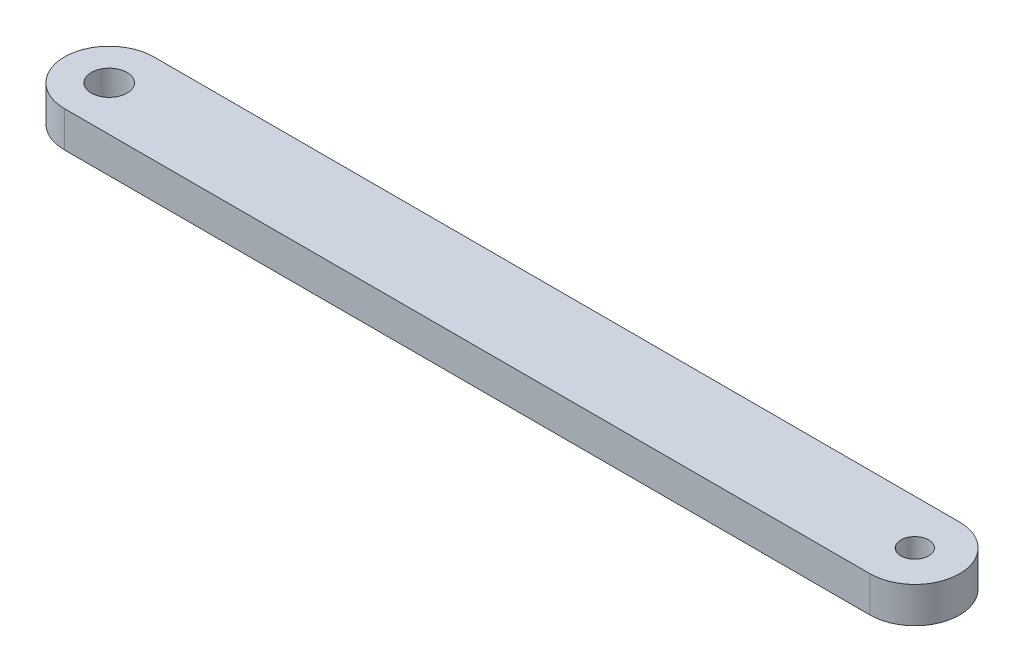
ISO-10303-21;
HEADER;
FILE_DESCRIPTION(('STEP AP214'),'2;1');
FILE_NAME('part.step','',(''),(''),'','','');
FILE_SCHEMA(('AUTOMOTIVE_DESIGN { 1 0 10303 214 1 1 1 1 }'));
ENDSEC;
DATA;
#1=APPLICATION_CONTEXT('core data for automotive mechanical design processes');
#2=APPLICATION_PROTOCOL_DEFINITION('international standard','automotive_design',2000,#1);
#3=PRODUCT_CONTEXT('',#1,'mechanical');
#4=PRODUCT('Part','Part','',(#3));
#5=PRODUCT_RELATED_PRODUCT_CATEGORY('part','',(#4));
#6=PRODUCT_DEFINITION_FORMATION('','',#4);
#7=PRODUCT_DEFINITION_CONTEXT('part definition',#1,'design');
#8=PRODUCT_DEFINITION('design','',#6,#7);
#9=PRODUCT_DEFINITION_SHAPE('','',#8);
#10=(LENGTH_UNIT() NAMED_UNIT(*) SI_UNIT(.MILLI.,.METRE.));
#11=(NAMED_UNIT(*) PLANE_ANGLE_UNIT() SI_UNIT($,.RADIAN.));
#12=(NAMED_UNIT(*) SI_UNIT($,.STERADIAN.) SOLID_ANGLE_UNIT());
#13=UNCERTAINTY_MEASURE_WITH_UNIT(LENGTH_MEASURE(1.E-05),#10,'distance_accuracy_value','');
#14=(GEOMETRIC_REPRESENTATION_CONTEXT(3) GLOBAL_UNCERTAINTY_ASSIGNED_CONTEXT((#13)) GLOBAL_UNIT_ASSIGNED_CONTEXT((#10,
#11,#12)) REPRESENTATION_CONTEXT('',''));
#15=CARTESIAN_POINT('',(0.,0.,0.));
#16=DIRECTION('',(0.,0.,1.));
#17=DIRECTION('',(1.,0.,0.));
#18=AXIS2_PLACEMENT_3D('',#15,#16,#17);
#19=CARTESIAN_POINT('',(0.,4.,0.));
#20=DIRECTION('',(0.,1.,0.));
#21=DIRECTION('',(0.,0.,1.));
#22=AXIS2_PLACEMENT_3D('',#19,#20,#21);
#23=PLANE('',#22);
#24=CARTESIAN_POINT('',(-90.,4.,0.));
#25=DIRECTION('',(0.,1.,0.));
#26=DIRECTION('',(0.,0.,1.));
#27=AXIS2_PLACEMENT_3D('',#24,#25,#26);
#28=CIRCLE('',#27,2.);
#29=CARTESIAN_POINT('',(-90.,4.,2.00000000000001));
#30=VERTEX_POINT('',#29);
#31=EDGE_CURVE('E112',#30,#30,#28,.T.);
#32=ORIENTED_EDGE('',*,*,#31,.F.);
#33=EDGE_LOOP('',(#32));
#34=FACE_BOUND('',#33,.T.);
#35=CARTESIAN_POINT('',(0.,4.,0.));
#36=DIRECTION('',(0.,1.,0.));
#37=DIRECTION('',(0.,0.,1.));
#38=AXIS2_PLACEMENT_3D('',#35,#36,#37);
#39=CIRCLE('',#38,5.);
#40=CARTESIAN_POINT('',(0.,4.,5.));
#41=VERTEX_POINT('',#40);
#42=CARTESIAN_POINT('',(0.,4.,-5.));
#43=VERTEX_POINT('',#42);
#44=EDGE_CURVE('E92',#41,#43,#39,.T.);
#45=ORIENTED_EDGE('',*,*,#44,.T.);
#46=DIRECTION('',(-1.,0.,0.));
#47=VECTOR('',#46,1.);
#48=CARTESIAN_POINT('',(0.,4.,-5.));
#49=LINE('',#48,#47);
#50=CARTESIAN_POINT('',(-90.,4.,-4.99999999999999));
#51=VERTEX_POINT('',#50);
#52=EDGE_CURVE('E87',#43,#51,#49,.T.);
#53=ORIENTED_EDGE('',*,*,#52,.T.);
#54=CARTESIAN_POINT('',(-90.,4.,0.));
#55=DIRECTION('',(0.,1.,0.));
#56=DIRECTION('',(0.,0.,1.));
#57=AXIS2_PLACEMENT_3D('',#54,#55,#56);
#58=CIRCLE('',#57,5.);
#59=CARTESIAN_POINT('',(-90.,4.,5.00000000000001));
#60=VERTEX_POINT('',#59);
#61=EDGE_CURVE('E90',#51,#60,#58,.T.);
#62=ORIENTED_EDGE('',*,*,#61,.T.);
#63=DIRECTION('',(1.,0.,0.));
#64=VECTOR('',#63,1.);
#65=CARTESIAN_POINT('',(0.,4.,5.));
#66=LINE('',#65,#64);
#67=EDGE_CURVE('E57',#60,#41,#66,.T.);
#68=ORIENTED_EDGE('',*,*,#67,.T.);
#69=EDGE_LOOP('',(#45,#53,#62,#68));
#70=FACE_BOUND('',#69,.T.);
#71=CARTESIAN_POINT('',(0.,4.,0.));
#72=DIRECTION('',(0.,1.,0.));
#73=DIRECTION('',(0.,0.,1.));
#74=AXIS2_PLACEMENT_3D('',#71,#72,#73);
#75=CIRCLE('',#74,1.55);
#76=CARTESIAN_POINT('',(0.,4.,1.55));
#77=VERTEX_POINT('',#76);
#78=EDGE_CURVE('E134',#77,#77,#75,.T.);
#79=ORIENTED_EDGE('',*,*,#78,.F.);
#80=EDGE_LOOP('',(#79));
#81=FACE_BOUND('',#80,.T.);
#82=ADVANCED_FACE('F39',(#34,#70,#81),#23,.T.);
#83=CARTESIAN_POINT('',(0.,0.,0.));
#84=DIRECTION('',(0.,1.,0.));
#85=DIRECTION('',(0.,0.,1.));
#86=AXIS2_PLACEMENT_3D('',#83,#84,#85);
#87=PLANE('',#86);
#88=CARTESIAN_POINT('',(0.,0.,0.));
#89=DIRECTION('',(0.,1.,0.));
#90=DIRECTION('',(0.,0.,1.));
#91=AXIS2_PLACEMENT_3D('',#88,#89,#90);
#92=CIRCLE('',#91,5.);
#93=CARTESIAN_POINT('',(0.,0.,5.));
#94=VERTEX_POINT('',#93);
#95=CARTESIAN_POINT('',(0.,0.,-5.));
#96=VERTEX_POINT('',#95);
#97=EDGE_CURVE('E108',#94,#96,#92,.T.);
#98=ORIENTED_EDGE('',*,*,#97,.F.);
#99=DIRECTION('',(1.,0.,0.));
#100=VECTOR('',#99,1.);
#101=CARTESIAN_POINT('',(0.,0.,5.));
#102=LINE('',#101,#100);
#103=CARTESIAN_POINT('',(-90.,0.,5.00000000000001));
#104=VERTEX_POINT('',#103);
#105=EDGE_CURVE('E80',#104,#94,#102,.T.);
#106=ORIENTED_EDGE('',*,*,#105,.F.);
#107=CARTESIAN_POINT('',(-90.,0.,0.));
#108=DIRECTION('',(0.,1.,0.));
#109=DIRECTION('',(0.,0.,1.));
#110=AXIS2_PLACEMENT_3D('',#107,#108,#109);
#111=CIRCLE('',#110,5.);
#112=CARTESIAN_POINT('',(-90.,0.,-4.99999999999999));
#113=VERTEX_POINT('',#112);
#114=EDGE_CURVE('E74',#113,#104,#111,.T.);
#115=ORIENTED_EDGE('',*,*,#114,.F.);
#116=DIRECTION('',(-1.,0.,0.));
#117=VECTOR('',#116,1.);
#118=CARTESIAN_POINT('',(0.,0.,-5.));
#119=LINE('',#118,#117);
#120=EDGE_CURVE('E97',#96,#113,#119,.T.);
#121=ORIENTED_EDGE('',*,*,#120,.F.);
#122=EDGE_LOOP('',(#98,#106,#115,#121));
#123=FACE_BOUND('',#122,.T.);
#124=CARTESIAN_POINT('',(-90.,0.,0.));
#125=DIRECTION('',(0.,1.,0.));
#126=DIRECTION('',(0.,0.,1.));
#127=AXIS2_PLACEMENT_3D('',#124,#125,#126);
#128=CIRCLE('',#127,2.);
#129=CARTESIAN_POINT('',(-90.,0.,2.00000000000001));
#130=VERTEX_POINT('',#129);
#131=EDGE_CURVE('E130',#130,#130,#128,.T.);
#132=ORIENTED_EDGE('',*,*,#131,.T.);
#133=EDGE_LOOP('',(#132));
#134=FACE_BOUND('',#133,.T.);
#135=CARTESIAN_POINT('',(0.,0.,0.));
#136=DIRECTION('',(0.,1.,0.));
#137=DIRECTION('',(0.,0.,1.));
#138=AXIS2_PLACEMENT_3D('',#135,#136,#137);
#139=CIRCLE('',#138,1.55);
#140=CARTESIAN_POINT('',(0.,0.,1.55));
#141=VERTEX_POINT('',#140);
#142=EDGE_CURVE('E138',#141,#141,#139,.T.);
#143=ORIENTED_EDGE('',*,*,#142,.T.);
#144=EDGE_LOOP('',(#143));
#145=FACE_BOUND('',#144,.T.);
#146=ADVANCED_FACE('F125',(#123,#134,#145),#87,.F.);
#147=CARTESIAN_POINT('',(0.,4.,0.));
#148=DIRECTION('',(0.,-1.,0.));
#149=DIRECTION('',(0.,0.,-1.));
#150=AXIS2_PLACEMENT_3D('',#147,#148,#149);
#151=CYLINDRICAL_SURFACE('',#150,5.);
#152=ORIENTED_EDGE('',*,*,#97,.T.);
#153=DIRECTION('',(0.,-1.,0.));
#154=VECTOR('',#153,1.);
#155=CARTESIAN_POINT('',(0.,4.,-5.));
#156=LINE('',#155,#154);
#157=EDGE_CURVE('E11',#43,#96,#156,.T.);
#158=ORIENTED_EDGE('',*,*,#157,.F.);
#159=ORIENTED_EDGE('',*,*,#44,.F.);
#160=DIRECTION('',(0.,-1.,0.));
#161=VECTOR('',#160,1.);
#162=CARTESIAN_POINT('',(0.,4.,5.));
#163=LINE('',#162,#161);
#164=EDGE_CURVE('E104',#41,#94,#163,.T.);
#165=ORIENTED_EDGE('',*,*,#164,.T.);
#166=EDGE_LOOP('',(#152,#158,#159,#165));
#167=FACE_BOUND('',#166,.T.);
#168=ADVANCED_FACE('F41',(#167),#151,.T.);
#169=CARTESIAN_POINT('',(0.,4.,-5.));
#170=DIRECTION('',(0.,0.,1.));
#171=DIRECTION('',(1.,0.,0.));
#172=AXIS2_PLACEMENT_3D('',#169,#170,#171);
#173=PLANE('',#172);
#174=ORIENTED_EDGE('',*,*,#120,.T.);
#175=DIRECTION('',(0.,-1.,0.));
#176=VECTOR('',#175,1.);
#177=CARTESIAN_POINT('',(-90.,4.,-4.99999999999999));
#178=LINE('',#177,#176);
#179=EDGE_CURVE('E49',#51,#113,#178,.T.);
#180=ORIENTED_EDGE('',*,*,#179,.F.);
#181=ORIENTED_EDGE('',*,*,#52,.F.);
#182=ORIENTED_EDGE('',*,*,#157,.T.);
#183=EDGE_LOOP('',(#174,#180,#181,#182));
#184=FACE_BOUND('',#183,.T.);
#185=ADVANCED_FACE('F96',(#184),#173,.F.);
#186=CARTESIAN_POINT('',(-90.,4.,0.));
#187=DIRECTION('',(0.,-1.,0.));
#188=DIRECTION('',(0.,0.,-1.));
#189=AXIS2_PLACEMENT_3D('',#186,#187,#188);
#190=CYLINDRICAL_SURFACE('',#189,5.);
#191=ORIENTED_EDGE('',*,*,#114,.T.);
#192=DIRECTION('',(0.,-1.,0.));
#193=VECTOR('',#192,1.);
#194=CARTESIAN_POINT('',(-90.,4.,5.00000000000001));
#195=LINE('',#194,#193);
#196=EDGE_CURVE('E99',#60,#104,#195,.T.);
#197=ORIENTED_EDGE('',*,*,#196,.F.);
#198=ORIENTED_EDGE('',*,*,#61,.F.);
#199=ORIENTED_EDGE('',*,*,#179,.T.);
#200=EDGE_LOOP('',(#191,#197,#198,#199));
#201=FACE_BOUND('',#200,.T.);
#202=ADVANCED_FACE('F100',(#201),#190,.T.);
#203=CARTESIAN_POINT('',(0.,4.,5.));
#204=DIRECTION('',(0.,0.,-1.));
#205=DIRECTION('',(-1.,0.,0.));
#206=AXIS2_PLACEMENT_3D('',#203,#204,#205);
#207=PLANE('',#206);
#208=ORIENTED_EDGE('',*,*,#105,.T.);
#209=ORIENTED_EDGE('',*,*,#164,.F.);
#210=ORIENTED_EDGE('',*,*,#67,.F.);
#211=ORIENTED_EDGE('',*,*,#196,.T.);
#212=EDGE_LOOP('',(#208,#209,#210,#211));
#213=FACE_BOUND('',#212,.T.);
#214=ADVANCED_FACE('F122',(#213),#207,.F.);
#215=CARTESIAN_POINT('',(-90.,4.,0.));
#216=DIRECTION('',(0.,-1.,0.));
#217=DIRECTION('',(0.,0.,-1.));
#218=AXIS2_PLACEMENT_3D('',#215,#216,#217);
#219=CYLINDRICAL_SURFACE('',#218,2.);
#220=ORIENTED_EDGE('',*,*,#31,.T.);
#221=EDGE_LOOP('',(#220));
#222=FACE_BOUND('',#221,.T.);
#223=ORIENTED_EDGE('',*,*,#131,.F.);
#224=EDGE_LOOP('',(#223));
#225=FACE_BOUND('',#224,.T.);
#226=ADVANCED_FACE('F157',(#222,#225),#219,.F.);
#227=CARTESIAN_POINT('',(0.,4.,0.));
#228=DIRECTION('',(0.,-1.,0.));
#229=DIRECTION('',(0.,0.,-1.));
#230=AXIS2_PLACEMENT_3D('',#227,#228,#229);
#231=CYLINDRICAL_SURFACE('',#230,1.55);
#232=ORIENTED_EDGE('',*,*,#78,.T.);
#233=EDGE_LOOP('',(#232));
#234=FACE_BOUND('',#233,.T.);
#235=ORIENTED_EDGE('',*,*,#142,.F.);
#236=EDGE_LOOP('',(#235));
#237=FACE_BOUND('',#236,.T.);
#238=ADVANCED_FACE('F146',(#234,#237),#231,.F.);
#239=CLOSED_SHELL('',(#82,#146,#168,#185,#202,#214,#226,#238));
#240=MANIFOLD_SOLID_BREP('B2',#239);
#241=ADVANCED_BREP_SHAPE_REPRESENTATION('',(#18,#240),#14);
#242=SHAPE_DEFINITION_REPRESENTATION(#9,#241);
ENDSEC;
END-ISO-10303-21;
